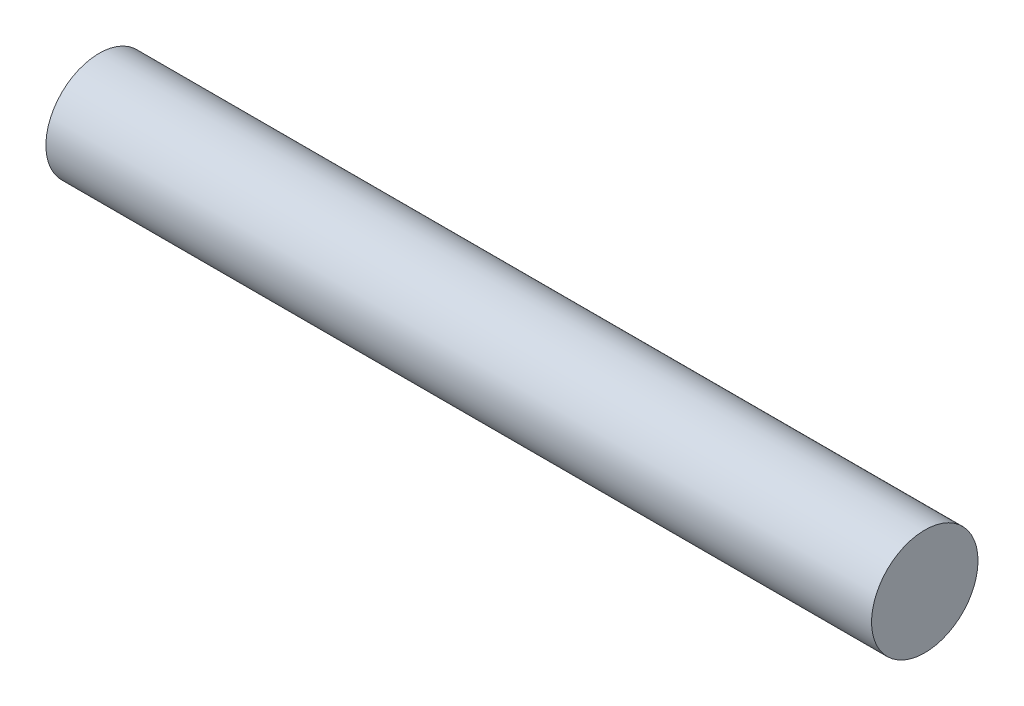
ISO-10303-21;
HEADER;
FILE_DESCRIPTION(('STEP AP214'),'2;1');
FILE_NAME('part.step','',(''),(''),'','','');
FILE_SCHEMA(('AUTOMOTIVE_DESIGN { 1 0 10303 214 1 1 1 1 }'));
ENDSEC;
DATA;
#1=APPLICATION_CONTEXT('core data for automotive mechanical design processes');
#2=APPLICATION_PROTOCOL_DEFINITION('international standard','automotive_design',2000,#1);
#3=PRODUCT_CONTEXT('',#1,'mechanical');
#4=PRODUCT('Part','Part','',(#3));
#5=PRODUCT_RELATED_PRODUCT_CATEGORY('part','',(#4));
#6=PRODUCT_DEFINITION_FORMATION('','',#4);
#7=PRODUCT_DEFINITION_CONTEXT('part definition',#1,'design');
#8=PRODUCT_DEFINITION('design','',#6,#7);
#9=PRODUCT_DEFINITION_SHAPE('','',#8);
#10=(LENGTH_UNIT() NAMED_UNIT(*) SI_UNIT(.MILLI.,.METRE.));
#11=(NAMED_UNIT(*) PLANE_ANGLE_UNIT() SI_UNIT($,.RADIAN.));
#12=(NAMED_UNIT(*) SI_UNIT($,.STERADIAN.) SOLID_ANGLE_UNIT());
#13=UNCERTAINTY_MEASURE_WITH_UNIT(LENGTH_MEASURE(1.E-05),#10,'distance_accuracy_value','');
#14=(GEOMETRIC_REPRESENTATION_CONTEXT(3) GLOBAL_UNCERTAINTY_ASSIGNED_CONTEXT((#13)) GLOBAL_UNIT_ASSIGNED_CONTEXT((#10,
#11,#12)) REPRESENTATION_CONTEXT('',''));
#15=CARTESIAN_POINT('',(0.,0.,0.));
#16=DIRECTION('',(0.,0.,1.));
#17=DIRECTION('',(1.,0.,0.));
#18=AXIS2_PLACEMENT_3D('',#15,#16,#17);
#19=CARTESIAN_POINT('',(-5.315,0.,0.));
#20=DIRECTION('',(1.,0.,0.));
#21=DIRECTION('',(0.,0.,-1.));
#22=AXIS2_PLACEMENT_3D('',#19,#20,#21);
#23=CYLINDRICAL_SURFACE('',#22,0.685);
#24=CARTESIAN_POINT('',(-5.315,0.,0.));
#25=DIRECTION('',(1.,0.,0.));
#26=DIRECTION('',(0.,0.,-1.));
#27=AXIS2_PLACEMENT_3D('',#24,#25,#26);
#28=CIRCLE('',#27,0.685);
#29=CARTESIAN_POINT('',(-5.315,0.,-0.685));
#30=VERTEX_POINT('',#29);
#31=EDGE_CURVE('E10',#30,#30,#28,.T.);
#32=ORIENTED_EDGE('',*,*,#31,.T.);
#33=EDGE_LOOP('',(#32));
#34=FACE_BOUND('',#33,.T.);
#35=CARTESIAN_POINT('',(5.315,0.,0.));
#36=DIRECTION('',(1.,0.,0.));
#37=DIRECTION('',(0.,0.,-1.));
#38=AXIS2_PLACEMENT_3D('',#35,#36,#37);
#39=CIRCLE('',#38,0.685);
#40=CARTESIAN_POINT('',(5.315,0.,-0.685));
#41=VERTEX_POINT('',#40);
#42=EDGE_CURVE('E48',#41,#41,#39,.T.);
#43=ORIENTED_EDGE('',*,*,#42,.F.);
#44=EDGE_LOOP('',(#43));
#45=FACE_BOUND('',#44,.T.);
#46=ADVANCED_FACE('F41',(#34,#45),#23,.T.);
#47=CARTESIAN_POINT('',(-5.315,0.,0.));
#48=DIRECTION('',(1.,0.,0.));
#49=DIRECTION('',(0.,0.,-1.));
#50=AXIS2_PLACEMENT_3D('',#47,#48,#49);
#51=PLANE('',#50);
#52=ORIENTED_EDGE('',*,*,#31,.F.);
#53=EDGE_LOOP('',(#52));
#54=FACE_BOUND('',#53,.T.);
#55=ADVANCED_FACE('F58',(#54),#51,.F.);
#56=CARTESIAN_POINT('',(5.315,0.,0.));
#57=DIRECTION('',(1.,0.,0.));
#58=DIRECTION('',(0.,0.,-1.));
#59=AXIS2_PLACEMENT_3D('',#56,#57,#58);
#60=PLANE('',#59);
#61=ORIENTED_EDGE('',*,*,#42,.T.);
#62=EDGE_LOOP('',(#61));
#63=FACE_BOUND('',#62,.T.);
#64=ADVANCED_FACE('F55',(#63),#60,.T.);
#65=CLOSED_SHELL('',(#46,#55,#64));
#66=MANIFOLD_SOLID_BREP('B2',#65);
#67=ADVANCED_BREP_SHAPE_REPRESENTATION('',(#18,#66),#14);
#68=SHAPE_DEFINITION_REPRESENTATION(#9,#67);
ENDSEC;
END-ISO-10303-21;
